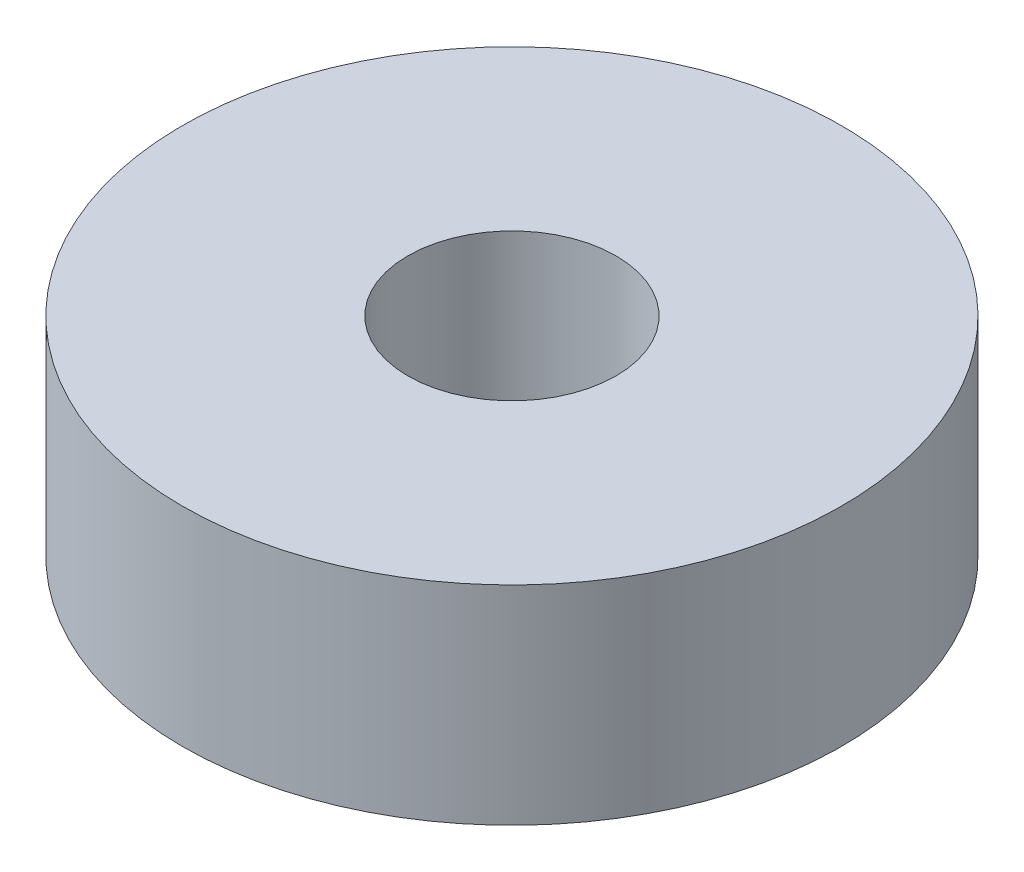
ISO-10303-21;
HEADER;
FILE_DESCRIPTION(('STEP AP214'),'2;1');
FILE_NAME('part.step','',(''),(''),'','','');
FILE_SCHEMA(('AUTOMOTIVE_DESIGN { 1 0 10303 214 1 1 1 1 }'));
ENDSEC;
DATA;
#1=APPLICATION_CONTEXT('core data for automotive mechanical design processes');
#2=APPLICATION_PROTOCOL_DEFINITION('international standard','automotive_design',2000,#1);
#3=PRODUCT_CONTEXT('',#1,'mechanical');
#4=PRODUCT('Part','Part','',(#3));
#5=PRODUCT_RELATED_PRODUCT_CATEGORY('part','',(#4));
#6=PRODUCT_DEFINITION_FORMATION('','',#4);
#7=PRODUCT_DEFINITION_CONTEXT('part definition',#1,'design');
#8=PRODUCT_DEFINITION('design','',#6,#7);
#9=PRODUCT_DEFINITION_SHAPE('','',#8);
#10=(LENGTH_UNIT() NAMED_UNIT(*) SI_UNIT(.MILLI.,.METRE.));
#11=(NAMED_UNIT(*) PLANE_ANGLE_UNIT() SI_UNIT($,.RADIAN.));
#12=(NAMED_UNIT(*) SI_UNIT($,.STERADIAN.) SOLID_ANGLE_UNIT());
#13=UNCERTAINTY_MEASURE_WITH_UNIT(LENGTH_MEASURE(1.E-05),#10,'distance_accuracy_value','');
#14=(GEOMETRIC_REPRESENTATION_CONTEXT(3) GLOBAL_UNCERTAINTY_ASSIGNED_CONTEXT((#13)) GLOBAL_UNIT_ASSIGNED_CONTEXT((#10,
#11,#12)) REPRESENTATION_CONTEXT('',''));
#15=CARTESIAN_POINT('',(0.,0.,0.));
#16=DIRECTION('',(0.,0.,1.));
#17=DIRECTION('',(1.,0.,0.));
#18=AXIS2_PLACEMENT_3D('',#15,#16,#17);
#19=CARTESIAN_POINT('',(0.,6.,0.));
#20=DIRECTION('',(0.,1.,0.));
#21=DIRECTION('',(0.,0.,1.));
#22=AXIS2_PLACEMENT_3D('',#19,#20,#21);
#23=PLANE('',#22);
#24=CARTESIAN_POINT('',(0.,6.,0.));
#25=DIRECTION('',(0.,1.,0.));
#26=DIRECTION('',(0.,0.,1.));
#27=AXIS2_PLACEMENT_3D('',#24,#25,#26);
#28=CIRCLE('',#27,9.5);
#29=CARTESIAN_POINT('',(0.,6.,9.5));
#30=VERTEX_POINT('',#29);
#31=EDGE_CURVE('E10',#30,#30,#28,.T.);
#32=ORIENTED_EDGE('',*,*,#31,.T.);
#33=EDGE_LOOP('',(#32));
#34=FACE_BOUND('',#33,.T.);
#35=CARTESIAN_POINT('',(0.,6.,0.));
#36=DIRECTION('',(0.,1.,0.));
#37=DIRECTION('',(0.,0.,1.));
#38=AXIS2_PLACEMENT_3D('',#35,#36,#37);
#39=CIRCLE('',#38,3.);
#40=CARTESIAN_POINT('',(0.,6.,3.));
#41=VERTEX_POINT('',#40);
#42=EDGE_CURVE('E50',#41,#41,#39,.T.);
#43=ORIENTED_EDGE('',*,*,#42,.F.);
#44=EDGE_LOOP('',(#43));
#45=FACE_BOUND('',#44,.T.);
#46=ADVANCED_FACE('F39',(#34,#45),#23,.T.);
#47=CARTESIAN_POINT('',(0.,0.,0.));
#48=DIRECTION('',(0.,1.,0.));
#49=DIRECTION('',(0.,0.,1.));
#50=AXIS2_PLACEMENT_3D('',#47,#48,#49);
#51=PLANE('',#50);
#52=CARTESIAN_POINT('',(0.,0.,0.));
#53=DIRECTION('',(0.,1.,0.));
#54=DIRECTION('',(0.,0.,1.));
#55=AXIS2_PLACEMENT_3D('',#52,#53,#54);
#56=CIRCLE('',#55,9.5);
#57=CARTESIAN_POINT('',(0.,0.,9.5));
#58=VERTEX_POINT('',#57);
#59=EDGE_CURVE('E43',#58,#58,#56,.T.);
#60=ORIENTED_EDGE('',*,*,#59,.F.);
#61=EDGE_LOOP('',(#60));
#62=FACE_BOUND('',#61,.T.);
#63=CARTESIAN_POINT('',(0.,0.,0.));
#64=DIRECTION('',(0.,1.,0.));
#65=DIRECTION('',(0.,0.,1.));
#66=AXIS2_PLACEMENT_3D('',#63,#64,#65);
#67=CIRCLE('',#66,3.);
#68=CARTESIAN_POINT('',(0.,0.,3.));
#69=VERTEX_POINT('',#68);
#70=EDGE_CURVE('E52',#69,#69,#67,.T.);
#71=ORIENTED_EDGE('',*,*,#70,.T.);
#72=EDGE_LOOP('',(#71));
#73=FACE_BOUND('',#72,.T.);
#74=ADVANCED_FACE('F62',(#62,#73),#51,.F.);
#75=CARTESIAN_POINT('',(0.,6.,0.));
#76=DIRECTION('',(0.,-1.,0.));
#77=DIRECTION('',(0.,0.,-1.));
#78=AXIS2_PLACEMENT_3D('',#75,#76,#77);
#79=CYLINDRICAL_SURFACE('',#78,9.5);
#80=ORIENTED_EDGE('',*,*,#31,.F.);
#81=EDGE_LOOP('',(#80));
#82=FACE_BOUND('',#81,.T.);
#83=ORIENTED_EDGE('',*,*,#59,.T.);
#84=EDGE_LOOP('',(#83));
#85=FACE_BOUND('',#84,.T.);
#86=ADVANCED_FACE('F41',(#82,#85),#79,.T.);
#87=CARTESIAN_POINT('',(0.,6.,0.));
#88=DIRECTION('',(0.,-1.,0.));
#89=DIRECTION('',(0.,0.,-1.));
#90=AXIS2_PLACEMENT_3D('',#87,#88,#89);
#91=CYLINDRICAL_SURFACE('',#90,3.);
#92=ORIENTED_EDGE('',*,*,#42,.T.);
#93=EDGE_LOOP('',(#92));
#94=FACE_BOUND('',#93,.T.);
#95=ORIENTED_EDGE('',*,*,#70,.F.);
#96=EDGE_LOOP('',(#95));
#97=FACE_BOUND('',#96,.T.);
#98=ADVANCED_FACE('F58',(#94,#97),#91,.F.);
#99=CLOSED_SHELL('',(#46,#74,#86,#98));
#100=MANIFOLD_SOLID_BREP('B2',#99);
#101=ADVANCED_BREP_SHAPE_REPRESENTATION('',(#18,#100),#14);
#102=SHAPE_DEFINITION_REPRESENTATION(#9,#101);
ENDSEC;
END-ISO-10303-21;
